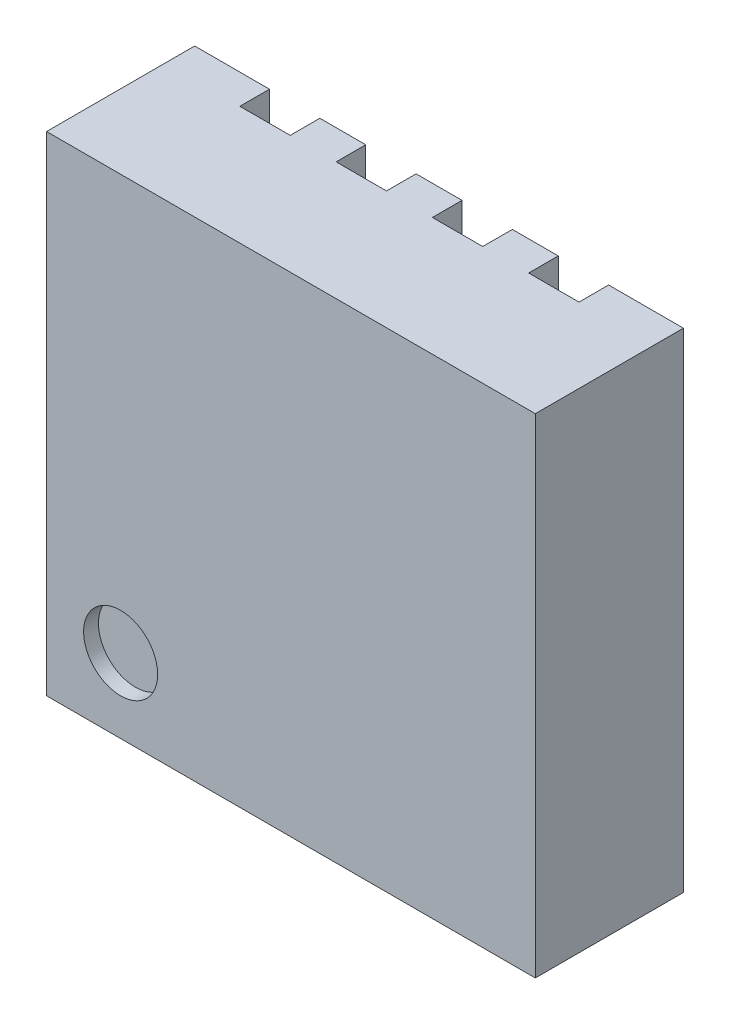
ISO-10303-21;
HEADER;
FILE_DESCRIPTION(('STEP AP214'),'2;1');
FILE_NAME('part.step','',(''),(''),'','','');
FILE_SCHEMA(('AUTOMOTIVE_DESIGN { 1 0 10303 214 1 1 1 1 }'));
ENDSEC;
DATA;
#1=APPLICATION_CONTEXT('core data for automotive mechanical design processes');
#2=APPLICATION_PROTOCOL_DEFINITION('international standard','automotive_design',2000,#1);
#3=PRODUCT_CONTEXT('',#1,'mechanical');
#4=PRODUCT('Part','Part','',(#3));
#5=PRODUCT_RELATED_PRODUCT_CATEGORY('part','',(#4));
#6=PRODUCT_DEFINITION_FORMATION('','',#4);
#7=PRODUCT_DEFINITION_CONTEXT('part definition',#1,'design');
#8=PRODUCT_DEFINITION('design','',#6,#7);
#9=PRODUCT_DEFINITION_SHAPE('','',#8);
#10=(LENGTH_UNIT() NAMED_UNIT(*) SI_UNIT(.MILLI.,.METRE.));
#11=(NAMED_UNIT(*) PLANE_ANGLE_UNIT() SI_UNIT($,.RADIAN.));
#12=(NAMED_UNIT(*) SI_UNIT($,.STERADIAN.) SOLID_ANGLE_UNIT());
#13=UNCERTAINTY_MEASURE_WITH_UNIT(LENGTH_MEASURE(1.E-05),#10,'distance_accuracy_value','');
#14=(GEOMETRIC_REPRESENTATION_CONTEXT(3) GLOBAL_UNCERTAINTY_ASSIGNED_CONTEXT((#13)) GLOBAL_UNIT_ASSIGNED_CONTEXT((#10,
#11,#12)) REPRESENTATION_CONTEXT('',''));
#15=CARTESIAN_POINT('',(0.,0.,0.));
#16=DIRECTION('',(0.,0.,1.));
#17=DIRECTION('',(1.,0.,0.));
#18=AXIS2_PLACEMENT_3D('',#15,#16,#17);
#19=CARTESIAN_POINT('',(0.,0.,0.));
#20=DIRECTION('',(0.,0.,1.));
#21=DIRECTION('',(1.,0.,0.));
#22=AXIS2_PLACEMENT_3D('',#19,#20,#21);
#23=PLANE('',#22);
#24=DIRECTION('',(-1.,0.,0.));
#25=VECTOR('',#24,1.);
#26=CARTESIAN_POINT('',(-1.65,1.65,0.));
#27=LINE('',#26,#25);
#28=CARTESIAN_POINT('',(0.805,1.65,0.));
#29=VERTEX_POINT('',#28);
#30=CARTESIAN_POINT('',(0.495,1.65,0.));
#31=VERTEX_POINT('',#30);
#32=EDGE_CURVE('E501',#29,#31,#27,.T.);
#33=ORIENTED_EDGE('',*,*,#32,.F.);
#34=DIRECTION('',(0.,1.,0.));
#35=VECTOR('',#34,1.);
#36=CARTESIAN_POINT('',(0.805,1.25,0.));
#37=LINE('',#36,#35);
#38=CARTESIAN_POINT('',(0.805,1.25,0.));
#39=VERTEX_POINT('',#38);
#40=EDGE_CURVE('E294',#39,#29,#37,.T.);
#41=ORIENTED_EDGE('',*,*,#40,.F.);
#42=DIRECTION('',(1.,0.,0.));
#43=VECTOR('',#42,1.);
#44=CARTESIAN_POINT('',(0.495,1.25,0.));
#45=LINE('',#44,#43);
#46=CARTESIAN_POINT('',(0.495,1.25,0.));
#47=VERTEX_POINT('',#46);
#48=EDGE_CURVE('E583',#47,#39,#45,.T.);
#49=ORIENTED_EDGE('',*,*,#48,.F.);
#50=DIRECTION('',(0.,-1.,0.));
#51=VECTOR('',#50,1.);
#52=CARTESIAN_POINT('',(0.495,1.65,0.));
#53=LINE('',#52,#51);
#54=EDGE_CURVE('E579',#31,#47,#53,.T.);
#55=ORIENTED_EDGE('',*,*,#54,.F.);
#56=EDGE_LOOP('',(#33,#41,#49,#55));
#57=FACE_BOUND('',#56,.T.);
#58=ADVANCED_FACE('F40',(#57),#23,.F.);
#59=CARTESIAN_POINT('',(0.155,1.65,0.));
#60=VERTEX_POINT('',#59);
#61=CARTESIAN_POINT('',(-0.155,1.65,0.));
#62=VERTEX_POINT('',#61);
#63=EDGE_CURVE('E694',#60,#62,#27,.T.);
#64=ORIENTED_EDGE('',*,*,#63,.F.);
#65=DIRECTION('',(0.,1.,0.));
#66=VECTOR('',#65,1.);
#67=CARTESIAN_POINT('',(0.155,1.65,0.));
#68=LINE('',#67,#66);
#69=CARTESIAN_POINT('',(0.155,1.25,0.));
#70=VERTEX_POINT('',#69);
#71=EDGE_CURVE('E576',#70,#60,#68,.T.);
#72=ORIENTED_EDGE('',*,*,#71,.F.);
#73=DIRECTION('',(1.,0.,0.));
#74=VECTOR('',#73,1.);
#75=CARTESIAN_POINT('',(0.155,1.25,0.));
#76=LINE('',#75,#74);
#77=CARTESIAN_POINT('',(-0.155,1.25,0.));
#78=VERTEX_POINT('',#77);
#79=EDGE_CURVE('E572',#78,#70,#76,.T.);
#80=ORIENTED_EDGE('',*,*,#79,.F.);
#81=DIRECTION('',(0.,-1.,0.));
#82=VECTOR('',#81,1.);
#83=CARTESIAN_POINT('',(-0.155,1.25,0.));
#84=LINE('',#83,#82);
#85=EDGE_CURVE('E568',#62,#78,#84,.T.);
#86=ORIENTED_EDGE('',*,*,#85,.F.);
#87=EDGE_LOOP('',(#64,#72,#80,#86));
#88=FACE_BOUND('',#87,.T.);
#89=ADVANCED_FACE('F723',(#88),#23,.F.);
#90=CARTESIAN_POINT('',(-0.495,1.65,0.));
#91=VERTEX_POINT('',#90);
#92=CARTESIAN_POINT('',(-0.805,1.65,0.));
#93=VERTEX_POINT('',#92);
#94=EDGE_CURVE('E697',#91,#93,#27,.T.);
#95=ORIENTED_EDGE('',*,*,#94,.F.);
#96=DIRECTION('',(0.,1.,0.));
#97=VECTOR('',#96,1.);
#98=CARTESIAN_POINT('',(-0.495,1.25,0.));
#99=LINE('',#98,#97);
#100=CARTESIAN_POINT('',(-0.495,1.25,0.));
#101=VERTEX_POINT('',#100);
#102=EDGE_CURVE('E565',#101,#91,#99,.T.);
#103=ORIENTED_EDGE('',*,*,#102,.F.);
#104=DIRECTION('',(1.,0.,0.));
#105=VECTOR('',#104,1.);
#106=CARTESIAN_POINT('',(-0.805,1.25,0.));
#107=LINE('',#106,#105);
#108=CARTESIAN_POINT('',(-0.805,1.25,0.));
#109=VERTEX_POINT('',#108);
#110=EDGE_CURVE('E561',#109,#101,#107,.T.);
#111=ORIENTED_EDGE('',*,*,#110,.F.);
#112=DIRECTION('',(0.,-1.,0.));
#113=VECTOR('',#112,1.);
#114=CARTESIAN_POINT('',(-0.805,1.65,0.));
#115=LINE('',#114,#113);
#116=EDGE_CURVE('E557',#93,#109,#115,.T.);
#117=ORIENTED_EDGE('',*,*,#116,.F.);
#118=EDGE_LOOP('',(#95,#103,#111,#117));
#119=FACE_BOUND('',#118,.T.);
#120=ADVANCED_FACE('F710',(#119),#23,.F.);
#121=DIRECTION('',(1.,0.,0.));
#122=VECTOR('',#121,1.);
#123=CARTESIAN_POINT('',(-1.65,-1.65,0.));
#124=LINE('',#123,#122);
#125=CARTESIAN_POINT('',(-0.805,-1.65,0.));
#126=VERTEX_POINT('',#125);
#127=CARTESIAN_POINT('',(-0.495,-1.65,0.));
#128=VERTEX_POINT('',#127);
#129=EDGE_CURVE('E508',#126,#128,#124,.T.);
#130=ORIENTED_EDGE('',*,*,#129,.F.);
#131=DIRECTION('',(0.,-1.,0.));
#132=VECTOR('',#131,1.);
#133=CARTESIAN_POINT('',(-0.805,-1.45,0.));
#134=LINE('',#133,#132);
#135=CARTESIAN_POINT('',(-0.805,-1.45,0.));
#136=VERTEX_POINT('',#135);
#137=EDGE_CURVE('E315',#136,#126,#134,.T.);
#138=ORIENTED_EDGE('',*,*,#137,.F.);
#139=DIRECTION('',(-1.,0.,0.));
#140=VECTOR('',#139,1.);
#141=CARTESIAN_POINT('',(-0.495,-1.45,0.));
#142=LINE('',#141,#140);
#143=CARTESIAN_POINT('',(-0.495,-1.45,0.));
#144=VERTEX_POINT('',#143);
#145=EDGE_CURVE('E387',#144,#136,#142,.T.);
#146=ORIENTED_EDGE('',*,*,#145,.F.);
#147=DIRECTION('',(0.,1.,0.));
#148=VECTOR('',#147,1.);
#149=CARTESIAN_POINT('',(-0.495,-1.65,0.));
#150=LINE('',#149,#148);
#151=EDGE_CURVE('E383',#128,#144,#150,.T.);
#152=ORIENTED_EDGE('',*,*,#151,.F.);
#153=EDGE_LOOP('',(#130,#138,#146,#152));
#154=FACE_BOUND('',#153,.T.);
#155=ADVANCED_FACE('F766',(#154),#23,.F.);
#156=CARTESIAN_POINT('',(-0.155,-1.65,0.));
#157=VERTEX_POINT('',#156);
#158=CARTESIAN_POINT('',(0.155,-1.65,0.));
#159=VERTEX_POINT('',#158);
#160=EDGE_CURVE('E777',#157,#159,#124,.T.);
#161=ORIENTED_EDGE('',*,*,#160,.F.);
#162=DIRECTION('',(0.,-1.,0.));
#163=VECTOR('',#162,1.);
#164=CARTESIAN_POINT('',(-0.155,-1.45,0.));
#165=LINE('',#164,#163);
#166=CARTESIAN_POINT('',(-0.155,-1.45,0.));
#167=VERTEX_POINT('',#166);
#168=EDGE_CURVE('E380',#167,#157,#165,.T.);
#169=ORIENTED_EDGE('',*,*,#168,.F.);
#170=DIRECTION('',(-1.,0.,0.));
#171=VECTOR('',#170,1.);
#172=CARTESIAN_POINT('',(0.155,-1.45,0.));
#173=LINE('',#172,#171);
#174=CARTESIAN_POINT('',(0.155,-1.45,0.));
#175=VERTEX_POINT('',#174);
#176=EDGE_CURVE('E376',#175,#167,#173,.T.);
#177=ORIENTED_EDGE('',*,*,#176,.F.);
#178=DIRECTION('',(0.,1.,0.));
#179=VECTOR('',#178,1.);
#180=CARTESIAN_POINT('',(0.155,-1.65,0.));
#181=LINE('',#180,#179);
#182=EDGE_CURVE('E372',#159,#175,#181,.T.);
#183=ORIENTED_EDGE('',*,*,#182,.F.);
#184=EDGE_LOOP('',(#161,#169,#177,#183));
#185=FACE_BOUND('',#184,.T.);
#186=ADVANCED_FACE('F754',(#185),#23,.F.);
#187=CARTESIAN_POINT('',(1.65,1.65,1.));
#188=DIRECTION('',(-1.,0.,0.));
#189=DIRECTION('',(0.,-1.,0.));
#190=AXIS2_PLACEMENT_3D('',#187,#188,#189);
#191=PLANE('',#190);
#192=DIRECTION('',(0.,1.,0.));
#193=VECTOR('',#192,1.);
#194=CARTESIAN_POINT('',(1.65,1.65,0.));
#195=LINE('',#194,#193);
#196=CARTESIAN_POINT('',(1.65,-1.65,0.));
#197=VERTEX_POINT('',#196);
#198=CARTESIAN_POINT('',(1.65,1.65,0.));
#199=VERTEX_POINT('',#198);
#200=EDGE_CURVE('E473',#197,#199,#195,.T.);
#201=ORIENTED_EDGE('',*,*,#200,.T.);
#202=DIRECTION('',(0.,0.,-1.));
#203=VECTOR('',#202,1.);
#204=CARTESIAN_POINT('',(1.65,1.65,1.));
#205=LINE('',#204,#203);
#206=CARTESIAN_POINT('',(1.65,1.65,1.));
#207=VERTEX_POINT('',#206);
#208=EDGE_CURVE('E11',#207,#199,#205,.T.);
#209=ORIENTED_EDGE('',*,*,#208,.F.);
#210=DIRECTION('',(0.,1.,0.));
#211=VECTOR('',#210,1.);
#212=CARTESIAN_POINT('',(1.65,1.65,1.));
#213=LINE('',#212,#211);
#214=CARTESIAN_POINT('',(1.65,-1.65,1.));
#215=VERTEX_POINT('',#214);
#216=EDGE_CURVE('E479',#215,#207,#213,.T.);
#217=ORIENTED_EDGE('',*,*,#216,.F.);
#218=DIRECTION('',(0.,0.,-1.));
#219=VECTOR('',#218,1.);
#220=CARTESIAN_POINT('',(1.65,-1.65,1.));
#221=LINE('',#220,#219);
#222=EDGE_CURVE('E493',#215,#197,#221,.T.);
#223=ORIENTED_EDGE('',*,*,#222,.T.);
#224=EDGE_LOOP('',(#201,#209,#217,#223));
#225=FACE_BOUND('',#224,.T.);
#226=ADVANCED_FACE('F42',(#225),#191,.F.);
#227=CARTESIAN_POINT('',(-1.65,1.65,1.));
#228=DIRECTION('',(0.,-1.,0.));
#229=DIRECTION('',(0.,0.,-1.));
#230=AXIS2_PLACEMENT_3D('',#227,#228,#229);
#231=PLANE('',#230);
#232=ORIENTED_EDGE('',*,*,#94,.T.);
#233=DIRECTION('',(0.,0.,-1.));
#234=VECTOR('',#233,1.);
#235=CARTESIAN_POINT('',(-0.805,1.65,0.2));
#236=LINE('',#235,#234);
#237=CARTESIAN_POINT('',(-0.805,1.65,0.2));
#238=VERTEX_POINT('',#237);
#239=EDGE_CURVE('E623',#238,#93,#236,.T.);
#240=ORIENTED_EDGE('',*,*,#239,.F.);
#241=DIRECTION('',(1.,0.,0.));
#242=VECTOR('',#241,1.);
#243=CARTESIAN_POINT('',(-1.145,1.65,0.2));
#244=LINE('',#243,#242);
#245=CARTESIAN_POINT('',(-1.145,1.65,0.2));
#246=VERTEX_POINT('',#245);
#247=EDGE_CURVE('E640',#246,#238,#244,.T.);
#248=ORIENTED_EDGE('',*,*,#247,.F.);
#249=DIRECTION('',(0.,0.,-1.));
#250=VECTOR('',#249,1.);
#251=CARTESIAN_POINT('',(-1.145,1.65,0.2));
#252=LINE('',#251,#250);
#253=CARTESIAN_POINT('',(-1.145,1.65,0.));
#254=VERTEX_POINT('',#253);
#255=EDGE_CURVE('E626',#246,#254,#252,.T.);
#256=ORIENTED_EDGE('',*,*,#255,.T.);
#257=CARTESIAN_POINT('',(-1.65,1.65,0.));
#258=VERTEX_POINT('',#257);
#259=EDGE_CURVE('E497',#254,#258,#27,.T.);
#260=ORIENTED_EDGE('',*,*,#259,.T.);
#261=DIRECTION('',(0.,0.,-1.));
#262=VECTOR('',#261,1.);
#263=CARTESIAN_POINT('',(-1.65,1.65,1.));
#264=LINE('',#263,#262);
#265=CARTESIAN_POINT('',(-1.65,1.65,1.));
#266=VERTEX_POINT('',#265);
#267=EDGE_CURVE('E49',#266,#258,#264,.T.);
#268=ORIENTED_EDGE('',*,*,#267,.F.);
#269=DIRECTION('',(-1.,0.,0.));
#270=VECTOR('',#269,1.);
#271=CARTESIAN_POINT('',(-1.65,1.65,1.));
#272=LINE('',#271,#270);
#273=EDGE_CURVE('E483',#207,#266,#272,.T.);
#274=ORIENTED_EDGE('',*,*,#273,.F.);
#275=ORIENTED_EDGE('',*,*,#208,.T.);
#276=CARTESIAN_POINT('',(1.145,1.65,0.));
#277=VERTEX_POINT('',#276);
#278=EDGE_CURVE('E299',#199,#277,#27,.T.);
#279=ORIENTED_EDGE('',*,*,#278,.T.);
#280=DIRECTION('',(0.,0.,-1.));
#281=VECTOR('',#280,1.);
#282=CARTESIAN_POINT('',(1.145,1.65,0.2));
#283=LINE('',#282,#281);
#284=CARTESIAN_POINT('',(1.145,1.65,0.2));
#285=VERTEX_POINT('',#284);
#286=EDGE_CURVE('E56',#285,#277,#283,.T.);
#287=ORIENTED_EDGE('',*,*,#286,.F.);
#288=DIRECTION('',(1.,0.,0.));
#289=VECTOR('',#288,1.);
#290=CARTESIAN_POINT('',(0.805,1.65,0.2));
#291=LINE('',#290,#289);
#292=CARTESIAN_POINT('',(0.805,1.65,0.2));
#293=VERTEX_POINT('',#292);
#294=EDGE_CURVE('E283',#293,#285,#291,.T.);
#295=ORIENTED_EDGE('',*,*,#294,.F.);
#296=DIRECTION('',(0.,0.,-1.));
#297=VECTOR('',#296,1.);
#298=CARTESIAN_POINT('',(0.805,1.65,0.2));
#299=LINE('',#298,#297);
#300=EDGE_CURVE('E478',#293,#29,#299,.T.);
#301=ORIENTED_EDGE('',*,*,#300,.T.);
#302=ORIENTED_EDGE('',*,*,#32,.T.);
#303=DIRECTION('',(0.,0.,-1.));
#304=VECTOR('',#303,1.);
#305=CARTESIAN_POINT('',(0.495,1.65,0.2));
#306=LINE('',#305,#304);
#307=CARTESIAN_POINT('',(0.495,1.65,0.2));
#308=VERTEX_POINT('',#307);
#309=EDGE_CURVE('E597',#308,#31,#306,.T.);
#310=ORIENTED_EDGE('',*,*,#309,.F.);
#311=DIRECTION('',(1.,0.,0.));
#312=VECTOR('',#311,1.);
#313=CARTESIAN_POINT('',(0.495,1.65,0.2));
#314=LINE('',#313,#312);
#315=CARTESIAN_POINT('',(0.155,1.65,0.2));
#316=VERTEX_POINT('',#315);
#317=EDGE_CURVE('E674',#316,#308,#314,.T.);
#318=ORIENTED_EDGE('',*,*,#317,.F.);
#319=DIRECTION('',(0.,0.,-1.));
#320=VECTOR('',#319,1.);
#321=CARTESIAN_POINT('',(0.155,1.65,0.2));
#322=LINE('',#321,#320);
#323=EDGE_CURVE('E600',#316,#60,#322,.T.);
#324=ORIENTED_EDGE('',*,*,#323,.T.);
#325=ORIENTED_EDGE('',*,*,#63,.T.);
#326=DIRECTION('',(0.,0.,-1.));
#327=VECTOR('',#326,1.);
#328=CARTESIAN_POINT('',(-0.155,1.65,0.2));
#329=LINE('',#328,#327);
#330=CARTESIAN_POINT('',(-0.155,1.65,0.2));
#331=VERTEX_POINT('',#330);
#332=EDGE_CURVE('E610',#331,#62,#329,.T.);
#333=ORIENTED_EDGE('',*,*,#332,.F.);
#334=DIRECTION('',(1.,0.,0.));
#335=VECTOR('',#334,1.);
#336=CARTESIAN_POINT('',(-0.155,1.65,0.2));
#337=LINE('',#336,#335);
#338=CARTESIAN_POINT('',(-0.495,1.65,0.2));
#339=VERTEX_POINT('',#338);
#340=EDGE_CURVE('E658',#339,#331,#337,.T.);
#341=ORIENTED_EDGE('',*,*,#340,.F.);
#342=DIRECTION('',(0.,0.,-1.));
#343=VECTOR('',#342,1.);
#344=CARTESIAN_POINT('',(-0.495,1.65,0.2));
#345=LINE('',#344,#343);
#346=EDGE_CURVE('E613',#339,#91,#345,.T.);
#347=ORIENTED_EDGE('',*,*,#346,.T.);
#348=EDGE_LOOP('',(#232,#240,#248,#256,#260,#268,#274,#275,#279,#287,#295,#301,#302,#310,#318,
#324,#325,#333,#341,#347));
#349=FACE_BOUND('',#348,.T.);
#350=ADVANCED_FACE('F298',(#349),#231,.F.);
#351=CARTESIAN_POINT('',(-1.65,1.65,1.));
#352=DIRECTION('',(1.,0.,0.));
#353=DIRECTION('',(0.,1.,0.));
#354=AXIS2_PLACEMENT_3D('',#351,#352,#353);
#355=PLANE('',#354);
#356=DIRECTION('',(0.,-1.,0.));
#357=VECTOR('',#356,1.);
#358=CARTESIAN_POINT('',(-1.65,1.65,0.));
#359=LINE('',#358,#357);
#360=CARTESIAN_POINT('',(-1.65,-1.65,0.));
#361=VERTEX_POINT('',#360);
#362=EDGE_CURVE('E500',#258,#361,#359,.T.);
#363=ORIENTED_EDGE('',*,*,#362,.T.);
#364=DIRECTION('',(0.,0.,-1.));
#365=VECTOR('',#364,1.);
#366=CARTESIAN_POINT('',(-1.65,-1.65,1.));
#367=LINE('',#366,#365);
#368=CARTESIAN_POINT('',(-1.65,-1.65,1.));
#369=VERTEX_POINT('',#368);
#370=EDGE_CURVE('E512',#369,#361,#367,.T.);
#371=ORIENTED_EDGE('',*,*,#370,.F.);
#372=DIRECTION('',(0.,-1.,0.));
#373=VECTOR('',#372,1.);
#374=CARTESIAN_POINT('',(-1.65,1.65,1.));
#375=LINE('',#374,#373);
#376=EDGE_CURVE('E487',#266,#369,#375,.T.);
#377=ORIENTED_EDGE('',*,*,#376,.F.);
#378=ORIENTED_EDGE('',*,*,#267,.T.);
#379=EDGE_LOOP('',(#363,#371,#377,#378));
#380=FACE_BOUND('',#379,.T.);
#381=ADVANCED_FACE('F521',(#380),#355,.F.);
#382=CARTESIAN_POINT('',(-1.65,-1.65,1.));
#383=DIRECTION('',(0.,1.,0.));
#384=DIRECTION('',(0.,0.,1.));
#385=AXIS2_PLACEMENT_3D('',#382,#383,#384);
#386=PLANE('',#385);
#387=ORIENTED_EDGE('',*,*,#160,.T.);
#388=DIRECTION('',(0.,0.,-1.));
#389=VECTOR('',#388,1.);
#390=CARTESIAN_POINT('',(0.155,-1.65,0.2));
#391=LINE('',#390,#389);
#392=CARTESIAN_POINT('',(0.155,-1.65,0.2));
#393=VERTEX_POINT('',#392);
#394=EDGE_CURVE('E417',#393,#159,#391,.T.);
#395=ORIENTED_EDGE('',*,*,#394,.F.);
#396=DIRECTION('',(-1.,0.,0.));
#397=VECTOR('',#396,1.);
#398=CARTESIAN_POINT('',(0.495,-1.65,0.2));
#399=LINE('',#398,#397);
#400=CARTESIAN_POINT('',(0.495,-1.65,0.2));
#401=VERTEX_POINT('',#400);
#402=EDGE_CURVE('E327',#401,#393,#399,.T.);
#403=ORIENTED_EDGE('',*,*,#402,.F.);
#404=DIRECTION('',(0.,0.,-1.));
#405=VECTOR('',#404,1.);
#406=CARTESIAN_POINT('',(0.495,-1.65,0.2));
#407=LINE('',#406,#405);
#408=CARTESIAN_POINT('',(0.495,-1.65,0.));
#409=VERTEX_POINT('',#408);
#410=EDGE_CURVE('E420',#401,#409,#407,.T.);
#411=ORIENTED_EDGE('',*,*,#410,.T.);
#412=CARTESIAN_POINT('',(0.805,-1.65,0.));
#413=VERTEX_POINT('',#412);
#414=EDGE_CURVE('E781',#409,#413,#124,.T.);
#415=ORIENTED_EDGE('',*,*,#414,.T.);
#416=DIRECTION('',(0.,0.,-1.));
#417=VECTOR('',#416,1.);
#418=CARTESIAN_POINT('',(0.805,-1.65,0.2));
#419=LINE('',#418,#417);
#420=CARTESIAN_POINT('',(0.805,-1.65,0.2));
#421=VERTEX_POINT('',#420);
#422=EDGE_CURVE('E64',#421,#413,#419,.T.);
#423=ORIENTED_EDGE('',*,*,#422,.F.);
#424=DIRECTION('',(-1.,0.,0.));
#425=VECTOR('',#424,1.);
#426=CARTESIAN_POINT('',(1.145,-1.65,0.2));
#427=LINE('',#426,#425);
#428=CARTESIAN_POINT('',(1.145,-1.65,0.2));
#429=VERTEX_POINT('',#428);
#430=EDGE_CURVE('E432',#429,#421,#427,.T.);
#431=ORIENTED_EDGE('',*,*,#430,.F.);
#432=DIRECTION('',(0.,0.,-1.));
#433=VECTOR('',#432,1.);
#434=CARTESIAN_POINT('',(1.145,-1.65,0.2));
#435=LINE('',#434,#433);
#436=CARTESIAN_POINT('',(1.145,-1.65,0.));
#437=VERTEX_POINT('',#436);
#438=EDGE_CURVE('E365',#429,#437,#435,.T.);
#439=ORIENTED_EDGE('',*,*,#438,.T.);
#440=EDGE_CURVE('E504',#437,#197,#124,.T.);
#441=ORIENTED_EDGE('',*,*,#440,.T.);
#442=ORIENTED_EDGE('',*,*,#222,.F.);
#443=DIRECTION('',(1.,0.,0.));
#444=VECTOR('',#443,1.);
#445=CARTESIAN_POINT('',(-1.65,-1.65,1.));
#446=LINE('',#445,#444);
#447=EDGE_CURVE('E490',#369,#215,#446,.T.);
#448=ORIENTED_EDGE('',*,*,#447,.F.);
#449=ORIENTED_EDGE('',*,*,#370,.T.);
#450=CARTESIAN_POINT('',(-1.145,-1.65,0.));
#451=VERTEX_POINT('',#450);
#452=EDGE_CURVE('E484',#361,#451,#124,.T.);
#453=ORIENTED_EDGE('',*,*,#452,.T.);
#454=DIRECTION('',(0.,0.,-1.));
#455=VECTOR('',#454,1.);
#456=CARTESIAN_POINT('',(-1.145,-1.65,0.2));
#457=LINE('',#456,#455);
#458=CARTESIAN_POINT('',(-1.145,-1.65,0.2));
#459=VERTEX_POINT('',#458);
#460=EDGE_CURVE('E359',#459,#451,#457,.T.);
#461=ORIENTED_EDGE('',*,*,#460,.F.);
#462=DIRECTION('',(-1.,0.,0.));
#463=VECTOR('',#462,1.);
#464=CARTESIAN_POINT('',(-0.805,-1.65,0.2));
#465=LINE('',#464,#463);
#466=CARTESIAN_POINT('',(-0.805,-1.65,0.2));
#467=VERTEX_POINT('',#466);
#468=EDGE_CURVE('E310',#467,#459,#465,.T.);
#469=ORIENTED_EDGE('',*,*,#468,.F.);
#470=DIRECTION('',(0.,0.,-1.));
#471=VECTOR('',#470,1.);
#472=CARTESIAN_POINT('',(-0.805,-1.65,0.2));
#473=LINE('',#472,#471);
#474=EDGE_CURVE('E393',#467,#126,#473,.T.);
#475=ORIENTED_EDGE('',*,*,#474,.T.);
#476=ORIENTED_EDGE('',*,*,#129,.T.);
#477=DIRECTION('',(0.,0.,-1.));
#478=VECTOR('',#477,1.);
#479=CARTESIAN_POINT('',(-0.495,-1.65,0.2));
#480=LINE('',#479,#478);
#481=CARTESIAN_POINT('',(-0.495,-1.65,0.2));
#482=VERTEX_POINT('',#481);
#483=EDGE_CURVE('E404',#482,#128,#480,.T.);
#484=ORIENTED_EDGE('',*,*,#483,.F.);
#485=DIRECTION('',(-1.,0.,0.));
#486=VECTOR('',#485,1.);
#487=CARTESIAN_POINT('',(-0.155,-1.65,0.2));
#488=LINE('',#487,#486);
#489=CARTESIAN_POINT('',(-0.155,-1.65,0.2));
#490=VERTEX_POINT('',#489);
#491=EDGE_CURVE('E343',#490,#482,#488,.T.);
#492=ORIENTED_EDGE('',*,*,#491,.F.);
#493=DIRECTION('',(0.,0.,-1.));
#494=VECTOR('',#493,1.);
#495=CARTESIAN_POINT('',(-0.155,-1.65,0.2));
#496=LINE('',#495,#494);
#497=EDGE_CURVE('E407',#490,#157,#496,.T.);
#498=ORIENTED_EDGE('',*,*,#497,.T.);
#499=EDGE_LOOP('',(#387,#395,#403,#411,#415,#423,#431,#439,#441,#442,#448,#449,#453,#461,#469,
#475,#476,#484,#492,#498));
#500=FACE_BOUND('',#499,.T.);
#501=ADVANCED_FACE('F533',(#500),#386,.F.);
#502=CARTESIAN_POINT('',(0.,0.,1.));
#503=DIRECTION('',(0.,0.,1.));
#504=DIRECTION('',(1.,0.,0.));
#505=AXIS2_PLACEMENT_3D('',#502,#503,#504);
#506=PLANE('',#505);
#507=CARTESIAN_POINT('',(-1.15,-1.15,1.));
#508=DIRECTION('',(0.,0.,1.));
#509=DIRECTION('',(1.,0.,0.));
#510=AXIS2_PLACEMENT_3D('',#507,#508,#509);
#511=CIRCLE('',#510,0.25);
#512=CARTESIAN_POINT('',(-0.9,-1.15,1.));
#513=VERTEX_POINT('',#512);
#514=EDGE_CURVE('E474',#513,#513,#511,.T.);
#515=ORIENTED_EDGE('',*,*,#514,.F.);
#516=EDGE_LOOP('',(#515));
#517=FACE_BOUND('',#516,.T.);
#518=ORIENTED_EDGE('',*,*,#216,.T.);
#519=ORIENTED_EDGE('',*,*,#273,.T.);
#520=ORIENTED_EDGE('',*,*,#376,.T.);
#521=ORIENTED_EDGE('',*,*,#447,.T.);
#522=EDGE_LOOP('',(#518,#519,#520,#521));
#523=FACE_BOUND('',#522,.T.);
#524=ADVANCED_FACE('F539',(#517,#523),#506,.T.);
#525=ORIENTED_EDGE('',*,*,#259,.F.);
#526=DIRECTION('',(0.,1.,0.));
#527=VECTOR('',#526,1.);
#528=CARTESIAN_POINT('',(-1.145,-0.46,0.));
#529=LINE('',#528,#527);
#530=CARTESIAN_POINT('',(-1.145,-0.46,0.));
#531=VERTEX_POINT('',#530);
#532=EDGE_CURVE('E551',#531,#254,#529,.T.);
#533=ORIENTED_EDGE('',*,*,#532,.F.);
#534=DIRECTION('',(-1.,0.,0.));
#535=VECTOR('',#534,1.);
#536=CARTESIAN_POINT('',(1.145,-0.46,0.));
#537=LINE('',#536,#535);
#538=CARTESIAN_POINT('',(1.145,-0.46,0.));
#539=VERTEX_POINT('',#538);
#540=EDGE_CURVE('E547',#539,#531,#537,.T.);
#541=ORIENTED_EDGE('',*,*,#540,.F.);
#542=DIRECTION('',(0.,-1.,0.));
#543=VECTOR('',#542,1.);
#544=CARTESIAN_POINT('',(1.145,1.65,0.));
#545=LINE('',#544,#543);
#546=EDGE_CURVE('E397',#277,#539,#545,.T.);
#547=ORIENTED_EDGE('',*,*,#546,.F.);
#548=ORIENTED_EDGE('',*,*,#278,.F.);
#549=ORIENTED_EDGE('',*,*,#200,.F.);
#550=ORIENTED_EDGE('',*,*,#440,.F.);
#551=DIRECTION('',(0.,-1.,0.));
#552=VECTOR('',#551,1.);
#553=CARTESIAN_POINT('',(1.145,-1.15,0.));
#554=LINE('',#553,#552);
#555=CARTESIAN_POINT('',(1.145,-1.15,0.));
#556=VERTEX_POINT('',#555);
#557=EDGE_CURVE('E437',#556,#437,#554,.T.);
#558=ORIENTED_EDGE('',*,*,#557,.F.);
#559=DIRECTION('',(1.,0.,0.));
#560=VECTOR('',#559,1.);
#561=CARTESIAN_POINT('',(0.805,-1.15,0.));
#562=LINE('',#561,#560);
#563=CARTESIAN_POINT('',(0.805,-1.15,0.));
#564=VERTEX_POINT('',#563);
#565=EDGE_CURVE('E452',#564,#556,#562,.T.);
#566=ORIENTED_EDGE('',*,*,#565,.F.);
#567=DIRECTION('',(0.,1.,0.));
#568=VECTOR('',#567,1.);
#569=CARTESIAN_POINT('',(0.805,-1.65,0.));
#570=LINE('',#569,#568);
#571=EDGE_CURVE('E449',#413,#564,#570,.T.);
#572=ORIENTED_EDGE('',*,*,#571,.F.);
#573=ORIENTED_EDGE('',*,*,#414,.F.);
#574=DIRECTION('',(0.,-1.,0.));
#575=VECTOR('',#574,1.);
#576=CARTESIAN_POINT('',(0.495,-1.05,0.));
#577=LINE('',#576,#575);
#578=CARTESIAN_POINT('',(0.495,-1.05,0.));
#579=VERTEX_POINT('',#578);
#580=EDGE_CURVE('E369',#579,#409,#577,.T.);
#581=ORIENTED_EDGE('',*,*,#580,.F.);
#582=DIRECTION('',(1.,0.,0.));
#583=VECTOR('',#582,1.);
#584=CARTESIAN_POINT('',(-1.145,-1.05,0.));
#585=LINE('',#584,#583);
#586=CARTESIAN_POINT('',(-1.145,-1.05,0.));
#587=VERTEX_POINT('',#586);
#588=EDGE_CURVE('E364',#587,#579,#585,.T.);
#589=ORIENTED_EDGE('',*,*,#588,.F.);
#590=DIRECTION('',(0.,1.,0.));
#591=VECTOR('',#590,1.);
#592=CARTESIAN_POINT('',(-1.145,-1.65,0.));
#593=LINE('',#592,#591);
#594=EDGE_CURVE('E360',#451,#587,#593,.T.);
#595=ORIENTED_EDGE('',*,*,#594,.F.);
#596=ORIENTED_EDGE('',*,*,#452,.F.);
#597=ORIENTED_EDGE('',*,*,#362,.F.);
#598=EDGE_LOOP('',(#525,#533,#541,#547,#548,#549,#550,#558,#566,#572,#573,#581,#589,#595,#596,#597));
#599=FACE_BOUND('',#598,.T.);
#600=ADVANCED_FACE('F526',(#599),#23,.F.);
#601=CARTESIAN_POINT('',(-1.15,-1.15,0.9));
#602=DIRECTION('',(0.,0.,1.));
#603=DIRECTION('',(1.,0.,0.));
#604=AXIS2_PLACEMENT_3D('',#601,#602,#603);
#605=CYLINDRICAL_SURFACE('',#604,0.25);
#606=CARTESIAN_POINT('',(-1.15,-1.15,0.9));
#607=DIRECTION('',(0.,0.,1.));
#608=DIRECTION('',(1.,0.,0.));
#609=AXIS2_PLACEMENT_3D('',#606,#607,#608);
#610=CIRCLE('',#609,0.25);
#611=CARTESIAN_POINT('',(-0.9,-1.15,0.9));
#612=VERTEX_POINT('',#611);
#613=EDGE_CURVE('E469',#612,#612,#610,.T.);
#614=ORIENTED_EDGE('',*,*,#613,.F.);
#615=EDGE_LOOP('',(#614));
#616=FACE_BOUND('',#615,.T.);
#617=ORIENTED_EDGE('',*,*,#514,.T.);
#618=EDGE_LOOP('',(#617));
#619=FACE_BOUND('',#618,.T.);
#620=ADVANCED_FACE('F753',(#616,#619),#605,.F.);
#621=CARTESIAN_POINT('',(-1.15,-1.15,0.9));
#622=DIRECTION('',(0.,0.,1.));
#623=DIRECTION('',(1.,0.,0.));
#624=AXIS2_PLACEMENT_3D('',#621,#622,#623);
#625=PLANE('',#624);
#626=ORIENTED_EDGE('',*,*,#613,.T.);
#627=EDGE_LOOP('',(#626));
#628=FACE_BOUND('',#627,.T.);
#629=ADVANCED_FACE('F760',(#628),#625,.T.);
#630=CARTESIAN_POINT('',(1.145,-1.15,0.2));
#631=DIRECTION('',(1.,0.,0.));
#632=DIRECTION('',(0.,0.,-1.));
#633=AXIS2_PLACEMENT_3D('',#630,#631,#632);
#634=PLANE('',#633);
#635=ORIENTED_EDGE('',*,*,#557,.T.);
#636=ORIENTED_EDGE('',*,*,#438,.F.);
#637=DIRECTION('',(0.,-1.,0.));
#638=VECTOR('',#637,1.);
#639=CARTESIAN_POINT('',(1.145,-1.15,0.2));
#640=LINE('',#639,#638);
#641=CARTESIAN_POINT('',(1.145,-1.15,0.2));
#642=VERTEX_POINT('',#641);
#643=EDGE_CURVE('E445',#642,#429,#640,.T.);
#644=ORIENTED_EDGE('',*,*,#643,.F.);
#645=DIRECTION('',(0.,0.,-1.));
#646=VECTOR('',#645,1.);
#647=CARTESIAN_POINT('',(1.145,-1.15,0.2));
#648=LINE('',#647,#646);
#649=EDGE_CURVE('E461',#642,#556,#648,.T.);
#650=ORIENTED_EDGE('',*,*,#649,.T.);
#651=EDGE_LOOP('',(#635,#636,#644,#650));
#652=FACE_BOUND('',#651,.T.);
#653=ADVANCED_FACE('F791',(#652),#634,.F.);
#654=CARTESIAN_POINT('',(0.805,-1.15,0.2));
#655=DIRECTION('',(0.,1.,0.));
#656=DIRECTION('',(0.,0.,1.));
#657=AXIS2_PLACEMENT_3D('',#654,#655,#656);
#658=PLANE('',#657);
#659=ORIENTED_EDGE('',*,*,#565,.T.);
#660=ORIENTED_EDGE('',*,*,#649,.F.);
#661=DIRECTION('',(1.,0.,0.));
#662=VECTOR('',#661,1.);
#663=CARTESIAN_POINT('',(0.805,-1.15,0.2));
#664=LINE('',#663,#662);
#665=CARTESIAN_POINT('',(0.805,-1.15,0.2));
#666=VERTEX_POINT('',#665);
#667=EDGE_CURVE('E441',#666,#642,#664,.T.);
#668=ORIENTED_EDGE('',*,*,#667,.F.);
#669=DIRECTION('',(0.,0.,-1.));
#670=VECTOR('',#669,1.);
#671=CARTESIAN_POINT('',(0.805,-1.15,0.2));
#672=LINE('',#671,#670);
#673=EDGE_CURVE('E464',#666,#564,#672,.T.);
#674=ORIENTED_EDGE('',*,*,#673,.T.);
#675=EDGE_LOOP('',(#659,#660,#668,#674));
#676=FACE_BOUND('',#675,.T.);
#677=ADVANCED_FACE('F796',(#676),#658,.F.);
#678=CARTESIAN_POINT('',(0.805,-1.65,0.2));
#679=DIRECTION('',(-1.,0.,0.));
#680=DIRECTION('',(0.,0.,1.));
#681=AXIS2_PLACEMENT_3D('',#678,#679,#680);
#682=PLANE('',#681);
#683=ORIENTED_EDGE('',*,*,#571,.T.);
#684=ORIENTED_EDGE('',*,*,#673,.F.);
#685=DIRECTION('',(0.,1.,0.));
#686=VECTOR('',#685,1.);
#687=CARTESIAN_POINT('',(0.805,-1.65,0.2));
#688=LINE('',#687,#686);
#689=EDGE_CURVE('E436',#421,#666,#688,.T.);
#690=ORIENTED_EDGE('',*,*,#689,.F.);
#691=ORIENTED_EDGE('',*,*,#422,.T.);
#692=EDGE_LOOP('',(#683,#684,#690,#691));
#693=FACE_BOUND('',#692,.T.);
#694=ADVANCED_FACE('F799',(#693),#682,.F.);
#695=CARTESIAN_POINT('',(0.,0.,0.2));
#696=DIRECTION('',(0.,0.,-1.));
#697=DIRECTION('',(-1.,0.,0.));
#698=AXIS2_PLACEMENT_3D('',#695,#696,#697);
#699=PLANE('',#698);
#700=ORIENTED_EDGE('',*,*,#430,.T.);
#701=ORIENTED_EDGE('',*,*,#689,.T.);
#702=ORIENTED_EDGE('',*,*,#667,.T.);
#703=ORIENTED_EDGE('',*,*,#643,.T.);
#704=EDGE_LOOP('',(#700,#701,#702,#703));
#705=FACE_BOUND('',#704,.T.);
#706=ADVANCED_FACE('F793',(#705),#699,.T.);
#707=CARTESIAN_POINT('',(-0.805,-1.45,0.2));
#708=DIRECTION('',(1.,0.,0.));
#709=DIRECTION('',(0.,0.,-1.));
#710=AXIS2_PLACEMENT_3D('',#707,#708,#709);
#711=PLANE('',#710);
#712=ORIENTED_EDGE('',*,*,#137,.T.);
#713=ORIENTED_EDGE('',*,*,#474,.F.);
#714=DIRECTION('',(0.,-1.,0.));
#715=VECTOR('',#714,1.);
#716=CARTESIAN_POINT('',(-0.805,-1.45,0.2));
#717=LINE('',#716,#715);
#718=CARTESIAN_POINT('',(-0.805,-1.45,0.2));
#719=VERTEX_POINT('',#718);
#720=EDGE_CURVE('E355',#719,#467,#717,.T.);
#721=ORIENTED_EDGE('',*,*,#720,.F.);
#722=DIRECTION('',(0.,0.,-1.));
#723=VECTOR('',#722,1.);
#724=CARTESIAN_POINT('',(-0.805,-1.45,0.2));
#725=LINE('',#724,#723);
#726=EDGE_CURVE('E398',#719,#136,#725,.T.);
#727=ORIENTED_EDGE('',*,*,#726,.T.);
#728=EDGE_LOOP('',(#712,#713,#721,#727));
#729=FACE_BOUND('',#728,.T.);
#730=ADVANCED_FACE('F806',(#729),#711,.F.);
#731=CARTESIAN_POINT('',(-0.495,-1.45,0.2));
#732=DIRECTION('',(0.,-1.,0.));
#733=DIRECTION('',(0.,0.,-1.));
#734=AXIS2_PLACEMENT_3D('',#731,#732,#733);
#735=PLANE('',#734);
#736=ORIENTED_EDGE('',*,*,#145,.T.);
#737=ORIENTED_EDGE('',*,*,#726,.F.);
#738=DIRECTION('',(-1.,0.,0.));
#739=VECTOR('',#738,1.);
#740=CARTESIAN_POINT('',(-0.495,-1.45,0.2));
#741=LINE('',#740,#739);
#742=CARTESIAN_POINT('',(-0.495,-1.45,0.2));
#743=VERTEX_POINT('',#742);
#744=EDGE_CURVE('E351',#743,#719,#741,.T.);
#745=ORIENTED_EDGE('',*,*,#744,.F.);
#746=DIRECTION('',(0.,0.,-1.));
#747=VECTOR('',#746,1.);
#748=CARTESIAN_POINT('',(-0.495,-1.45,0.2));
#749=LINE('',#748,#747);
#750=EDGE_CURVE('E401',#743,#144,#749,.T.);
#751=ORIENTED_EDGE('',*,*,#750,.T.);
#752=EDGE_LOOP('',(#736,#737,#745,#751));
#753=FACE_BOUND('',#752,.T.);
#754=ADVANCED_FACE('F849',(#753),#735,.F.);
#755=CARTESIAN_POINT('',(-0.495,-1.65,0.2));
#756=DIRECTION('',(-1.,0.,0.));
#757=DIRECTION('',(0.,0.,1.));
#758=AXIS2_PLACEMENT_3D('',#755,#756,#757);
#759=PLANE('',#758);
#760=ORIENTED_EDGE('',*,*,#151,.T.);
#761=ORIENTED_EDGE('',*,*,#750,.F.);
#762=DIRECTION('',(0.,1.,0.));
#763=VECTOR('',#762,1.);
#764=CARTESIAN_POINT('',(-0.495,-1.65,0.2));
#765=LINE('',#764,#763);
#766=EDGE_CURVE('E347',#482,#743,#765,.T.);
#767=ORIENTED_EDGE('',*,*,#766,.F.);
#768=ORIENTED_EDGE('',*,*,#483,.T.);
#769=EDGE_LOOP('',(#760,#761,#767,#768));
#770=FACE_BOUND('',#769,.T.);
#771=ADVANCED_FACE('F845',(#770),#759,.F.);
#772=CARTESIAN_POINT('',(-0.155,-1.45,0.2));
#773=DIRECTION('',(1.,0.,0.));
#774=DIRECTION('',(0.,1.,0.));
#775=AXIS2_PLACEMENT_3D('',#772,#773,#774);
#776=PLANE('',#775);
#777=ORIENTED_EDGE('',*,*,#168,.T.);
#778=ORIENTED_EDGE('',*,*,#497,.F.);
#779=DIRECTION('',(0.,-1.,0.));
#780=VECTOR('',#779,1.);
#781=CARTESIAN_POINT('',(-0.155,-1.45,0.2));
#782=LINE('',#781,#780);
#783=CARTESIAN_POINT('',(-0.155,-1.45,0.2));
#784=VERTEX_POINT('',#783);
#785=EDGE_CURVE('E339',#784,#490,#782,.T.);
#786=ORIENTED_EDGE('',*,*,#785,.F.);
#787=DIRECTION('',(0.,0.,-1.));
#788=VECTOR('',#787,1.);
#789=CARTESIAN_POINT('',(-0.155,-1.45,0.2));
#790=LINE('',#789,#788);
#791=EDGE_CURVE('E411',#784,#167,#790,.T.);
#792=ORIENTED_EDGE('',*,*,#791,.T.);
#793=EDGE_LOOP('',(#777,#778,#786,#792));
#794=FACE_BOUND('',#793,.T.);
#795=ADVANCED_FACE('F841',(#794),#776,.F.);
#796=CARTESIAN_POINT('',(0.155,-1.45,0.2));
#797=DIRECTION('',(0.,-1.,0.));
#798=DIRECTION('',(0.,0.,-1.));
#799=AXIS2_PLACEMENT_3D('',#796,#797,#798);
#800=PLANE('',#799);
#801=ORIENTED_EDGE('',*,*,#176,.T.);
#802=ORIENTED_EDGE('',*,*,#791,.F.);
#803=DIRECTION('',(-1.,0.,0.));
#804=VECTOR('',#803,1.);
#805=CARTESIAN_POINT('',(0.155,-1.45,0.2));
#806=LINE('',#805,#804);
#807=CARTESIAN_POINT('',(0.155,-1.45,0.2));
#808=VERTEX_POINT('',#807);
#809=EDGE_CURVE('E335',#808,#784,#806,.T.);
#810=ORIENTED_EDGE('',*,*,#809,.F.);
#811=DIRECTION('',(0.,0.,-1.));
#812=VECTOR('',#811,1.);
#813=CARTESIAN_POINT('',(0.155,-1.45,0.2));
#814=LINE('',#813,#812);
#815=EDGE_CURVE('E414',#808,#175,#814,.T.);
#816=ORIENTED_EDGE('',*,*,#815,.T.);
#817=EDGE_LOOP('',(#801,#802,#810,#816));
#818=FACE_BOUND('',#817,.T.);
#819=ADVANCED_FACE('F837',(#818),#800,.F.);
#820=CARTESIAN_POINT('',(0.155,-1.65,0.2));
#821=DIRECTION('',(-1.,0.,0.));
#822=DIRECTION('',(0.,0.,1.));
#823=AXIS2_PLACEMENT_3D('',#820,#821,#822);
#824=PLANE('',#823);
#825=ORIENTED_EDGE('',*,*,#182,.T.);
#826=ORIENTED_EDGE('',*,*,#815,.F.);
#827=DIRECTION('',(0.,1.,0.));
#828=VECTOR('',#827,1.);
#829=CARTESIAN_POINT('',(0.155,-1.65,0.2));
#830=LINE('',#829,#828);
#831=EDGE_CURVE('E331',#393,#808,#830,.T.);
#832=ORIENTED_EDGE('',*,*,#831,.F.);
#833=ORIENTED_EDGE('',*,*,#394,.T.);
#834=EDGE_LOOP('',(#825,#826,#832,#833));
#835=FACE_BOUND('',#834,.T.);
#836=ADVANCED_FACE('F833',(#835),#824,.F.);
#837=CARTESIAN_POINT('',(0.495,-1.05,0.2));
#838=DIRECTION('',(1.,0.,0.));
#839=DIRECTION('',(0.,0.,-1.));
#840=AXIS2_PLACEMENT_3D('',#837,#838,#839);
#841=PLANE('',#840);
#842=ORIENTED_EDGE('',*,*,#580,.T.);
#843=ORIENTED_EDGE('',*,*,#410,.F.);
#844=DIRECTION('',(0.,-1.,0.));
#845=VECTOR('',#844,1.);
#846=CARTESIAN_POINT('',(0.495,-1.05,0.2));
#847=LINE('',#846,#845);
#848=CARTESIAN_POINT('',(0.495,-1.05,0.2));
#849=VERTEX_POINT('',#848);
#850=EDGE_CURVE('E323',#849,#401,#847,.T.);
#851=ORIENTED_EDGE('',*,*,#850,.F.);
#852=DIRECTION('',(0.,0.,-1.));
#853=VECTOR('',#852,1.);
#854=CARTESIAN_POINT('',(0.495,-1.05,0.2));
#855=LINE('',#854,#853);
#856=EDGE_CURVE('E424',#849,#579,#855,.T.);
#857=ORIENTED_EDGE('',*,*,#856,.T.);
#858=EDGE_LOOP('',(#842,#843,#851,#857));
#859=FACE_BOUND('',#858,.T.);
#860=ADVANCED_FACE('F829',(#859),#841,.F.);
#861=CARTESIAN_POINT('',(-1.145,-1.05,0.2));
#862=DIRECTION('',(0.,1.,0.));
#863=DIRECTION('',(-1.,0.,0.));
#864=AXIS2_PLACEMENT_3D('',#861,#862,#863);
#865=PLANE('',#864);
#866=ORIENTED_EDGE('',*,*,#588,.T.);
#867=ORIENTED_EDGE('',*,*,#856,.F.);
#868=DIRECTION('',(1.,0.,0.));
#869=VECTOR('',#868,1.);
#870=CARTESIAN_POINT('',(-1.145,-1.05,0.2));
#871=LINE('',#870,#869);
#872=CARTESIAN_POINT('',(-1.145,-1.05,0.2));
#873=VERTEX_POINT('',#872);
#874=EDGE_CURVE('E319',#873,#849,#871,.T.);
#875=ORIENTED_EDGE('',*,*,#874,.F.);
#876=DIRECTION('',(0.,0.,-1.));
#877=VECTOR('',#876,1.);
#878=CARTESIAN_POINT('',(-1.145,-1.05,0.2));
#879=LINE('',#878,#877);
#880=EDGE_CURVE('E427',#873,#587,#879,.T.);
#881=ORIENTED_EDGE('',*,*,#880,.T.);
#882=EDGE_LOOP('',(#866,#867,#875,#881));
#883=FACE_BOUND('',#882,.T.);
#884=ADVANCED_FACE('F825',(#883),#865,.F.);
#885=CARTESIAN_POINT('',(-1.145,-1.65,0.2));
#886=DIRECTION('',(-1.,0.,0.));
#887=DIRECTION('',(0.,-1.,0.));
#888=AXIS2_PLACEMENT_3D('',#885,#886,#887);
#889=PLANE('',#888);
#890=ORIENTED_EDGE('',*,*,#594,.T.);
#891=ORIENTED_EDGE('',*,*,#880,.F.);
#892=DIRECTION('',(0.,1.,0.));
#893=VECTOR('',#892,1.);
#894=CARTESIAN_POINT('',(-1.145,-1.65,0.2));
#895=LINE('',#894,#893);
#896=EDGE_CURVE('E314',#459,#873,#895,.T.);
#897=ORIENTED_EDGE('',*,*,#896,.F.);
#898=ORIENTED_EDGE('',*,*,#460,.T.);
#899=EDGE_LOOP('',(#890,#891,#897,#898));
#900=FACE_BOUND('',#899,.T.);
#901=ADVANCED_FACE('F822',(#900),#889,.F.);
#902=CARTESIAN_POINT('',(0.,0.,0.2));
#903=DIRECTION('',(0.,0.,-1.));
#904=DIRECTION('',(-1.,0.,0.));
#905=AXIS2_PLACEMENT_3D('',#902,#903,#904);
#906=PLANE('',#905);
#907=ORIENTED_EDGE('',*,*,#468,.T.);
#908=ORIENTED_EDGE('',*,*,#896,.T.);
#909=ORIENTED_EDGE('',*,*,#874,.T.);
#910=ORIENTED_EDGE('',*,*,#850,.T.);
#911=ORIENTED_EDGE('',*,*,#402,.T.);
#912=ORIENTED_EDGE('',*,*,#831,.T.);
#913=ORIENTED_EDGE('',*,*,#809,.T.);
#914=ORIENTED_EDGE('',*,*,#785,.T.);
#915=ORIENTED_EDGE('',*,*,#491,.T.);
#916=ORIENTED_EDGE('',*,*,#766,.T.);
#917=ORIENTED_EDGE('',*,*,#744,.T.);
#918=ORIENTED_EDGE('',*,*,#720,.T.);
#919=EDGE_LOOP('',(#907,#908,#909,#910,#911,#912,#913,#914,#915,#916,#917,#918));
#920=FACE_BOUND('',#919,.T.);
#921=ADVANCED_FACE('F742',(#920),#906,.T.);
#922=CARTESIAN_POINT('',(0.805,1.25,0.2));
#923=DIRECTION('',(-1.,0.,0.));
#924=DIRECTION('',(0.,0.,1.));
#925=AXIS2_PLACEMENT_3D('',#922,#923,#924);
#926=PLANE('',#925);
#927=ORIENTED_EDGE('',*,*,#40,.T.);
#928=ORIENTED_EDGE('',*,*,#300,.F.);
#929=DIRECTION('',(0.,1.,0.));
#930=VECTOR('',#929,1.);
#931=CARTESIAN_POINT('',(0.805,1.25,0.2));
#932=LINE('',#931,#930);
#933=CARTESIAN_POINT('',(0.805,1.25,0.2));
#934=VERTEX_POINT('',#933);
#935=EDGE_CURVE('E290',#934,#293,#932,.T.);
#936=ORIENTED_EDGE('',*,*,#935,.F.);
#937=DIRECTION('',(0.,0.,-1.));
#938=VECTOR('',#937,1.);
#939=CARTESIAN_POINT('',(0.805,1.25,0.2));
#940=LINE('',#939,#938);
#941=EDGE_CURVE('E591',#934,#39,#940,.T.);
#942=ORIENTED_EDGE('',*,*,#941,.T.);
#943=EDGE_LOOP('',(#927,#928,#936,#942));
#944=FACE_BOUND('',#943,.T.);
#945=ADVANCED_FACE('F685',(#944),#926,.F.);
#946=CARTESIAN_POINT('',(0.495,1.25,0.2));
#947=DIRECTION('',(0.,1.,0.));
#948=DIRECTION('',(0.,0.,1.));
#949=AXIS2_PLACEMENT_3D('',#946,#947,#948);
#950=PLANE('',#949);
#951=ORIENTED_EDGE('',*,*,#48,.T.);
#952=ORIENTED_EDGE('',*,*,#941,.F.);
#953=DIRECTION('',(1.,0.,0.));
#954=VECTOR('',#953,1.);
#955=CARTESIAN_POINT('',(0.495,1.25,0.2));
#956=LINE('',#955,#954);
#957=CARTESIAN_POINT('',(0.495,1.25,0.2));
#958=VERTEX_POINT('',#957);
#959=EDGE_CURVE('E306',#958,#934,#956,.T.);
#960=ORIENTED_EDGE('',*,*,#959,.F.);
#961=DIRECTION('',(0.,0.,-1.));
#962=VECTOR('',#961,1.);
#963=CARTESIAN_POINT('',(0.495,1.25,0.2));
#964=LINE('',#963,#962);
#965=EDGE_CURVE('E594',#958,#47,#964,.T.);
#966=ORIENTED_EDGE('',*,*,#965,.T.);
#967=EDGE_LOOP('',(#951,#952,#960,#966));
#968=FACE_BOUND('',#967,.T.);
#969=ADVANCED_FACE('F733',(#968),#950,.F.);
#970=CARTESIAN_POINT('',(0.495,1.65,0.2));
#971=DIRECTION('',(1.,0.,0.));
#972=DIRECTION('',(0.,0.,-1.));
#973=AXIS2_PLACEMENT_3D('',#970,#971,#972);
#974=PLANE('',#973);
#975=ORIENTED_EDGE('',*,*,#54,.T.);
#976=ORIENTED_EDGE('',*,*,#965,.F.);
#977=DIRECTION('',(0.,-1.,0.));
#978=VECTOR('',#977,1.);
#979=CARTESIAN_POINT('',(0.495,1.65,0.2));
#980=LINE('',#979,#978);
#981=EDGE_CURVE('E678',#308,#958,#980,.T.);
#982=ORIENTED_EDGE('',*,*,#981,.F.);
#983=ORIENTED_EDGE('',*,*,#309,.T.);
#984=EDGE_LOOP('',(#975,#976,#982,#983));
#985=FACE_BOUND('',#984,.T.);
#986=ADVANCED_FACE('F732',(#985),#974,.F.);
#987=CARTESIAN_POINT('',(0.155,1.65,0.2));
#988=DIRECTION('',(-1.,0.,0.));
#989=DIRECTION('',(0.,-1.,0.));
#990=AXIS2_PLACEMENT_3D('',#987,#988,#989);
#991=PLANE('',#990);
#992=ORIENTED_EDGE('',*,*,#71,.T.);
#993=ORIENTED_EDGE('',*,*,#323,.F.);
#994=DIRECTION('',(0.,1.,0.));
#995=VECTOR('',#994,1.);
#996=CARTESIAN_POINT('',(0.155,1.65,0.2));
#997=LINE('',#996,#995);
#998=CARTESIAN_POINT('',(0.155,1.25,0.2));
#999=VERTEX_POINT('',#998);
#1000=EDGE_CURVE('E670',#999,#316,#997,.T.);
#1001=ORIENTED_EDGE('',*,*,#1000,.F.);
#1002=DIRECTION('',(0.,0.,-1.));
#1003=VECTOR('',#1002,1.);
#1004=CARTESIAN_POINT('',(0.155,1.25,0.2));
#1005=LINE('',#1004,#1003);
#1006=EDGE_CURVE('E604',#999,#70,#1005,.T.);
#1007=ORIENTED_EDGE('',*,*,#1006,.T.);
#1008=EDGE_LOOP('',(#992,#993,#1001,#1007));
#1009=FACE_BOUND('',#1008,.T.);
#1010=ADVANCED_FACE('F740',(#1009),#991,.F.);
#1011=CARTESIAN_POINT('',(0.155,1.25,0.2));
#1012=DIRECTION('',(0.,1.,0.));
#1013=DIRECTION('',(0.,0.,1.));
#1014=AXIS2_PLACEMENT_3D('',#1011,#1012,#1013);
#1015=PLANE('',#1014);
#1016=ORIENTED_EDGE('',*,*,#79,.T.);
#1017=ORIENTED_EDGE('',*,*,#1006,.F.);
#1018=DIRECTION('',(1.,0.,0.));
#1019=VECTOR('',#1018,1.);
#1020=CARTESIAN_POINT('',(0.155,1.25,0.2));
#1021=LINE('',#1020,#1019);
#1022=CARTESIAN_POINT('',(-0.155,1.25,0.2));
#1023=VERTEX_POINT('',#1022);
#1024=EDGE_CURVE('E666',#1023,#999,#1021,.T.);
#1025=ORIENTED_EDGE('',*,*,#1024,.F.);
#1026=DIRECTION('',(0.,0.,-1.));
#1027=VECTOR('',#1026,1.);
#1028=CARTESIAN_POINT('',(-0.155,1.25,0.2));
#1029=LINE('',#1028,#1027);
#1030=EDGE_CURVE('E607',#1023,#78,#1029,.T.);
#1031=ORIENTED_EDGE('',*,*,#1030,.T.);
#1032=EDGE_LOOP('',(#1016,#1017,#1025,#1031));
#1033=FACE_BOUND('',#1032,.T.);
#1034=ADVANCED_FACE('F726',(#1033),#1015,.F.);
#1035=CARTESIAN_POINT('',(-0.155,1.25,0.2));
#1036=DIRECTION('',(1.,0.,0.));
#1037=DIRECTION('',(0.,0.,-1.));
#1038=AXIS2_PLACEMENT_3D('',#1035,#1036,#1037);
#1039=PLANE('',#1038);
#1040=ORIENTED_EDGE('',*,*,#85,.T.);
#1041=ORIENTED_EDGE('',*,*,#1030,.F.);
#1042=DIRECTION('',(0.,-1.,0.));
#1043=VECTOR('',#1042,1.);
#1044=CARTESIAN_POINT('',(-0.155,1.25,0.2));
#1045=LINE('',#1044,#1043);
#1046=EDGE_CURVE('E662',#331,#1023,#1045,.T.);
#1047=ORIENTED_EDGE('',*,*,#1046,.F.);
#1048=ORIENTED_EDGE('',*,*,#332,.T.);
#1049=EDGE_LOOP('',(#1040,#1041,#1047,#1048));
#1050=FACE_BOUND('',#1049,.T.);
#1051=ADVANCED_FACE('F720',(#1050),#1039,.F.);
#1052=CARTESIAN_POINT('',(-0.495,1.25,0.2));
#1053=DIRECTION('',(-1.,0.,0.));
#1054=DIRECTION('',(0.,0.,1.));
#1055=AXIS2_PLACEMENT_3D('',#1052,#1053,#1054);
#1056=PLANE('',#1055);
#1057=ORIENTED_EDGE('',*,*,#102,.T.);
#1058=ORIENTED_EDGE('',*,*,#346,.F.);
#1059=DIRECTION('',(0.,1.,0.));
#1060=VECTOR('',#1059,1.);
#1061=CARTESIAN_POINT('',(-0.495,1.25,0.2));
#1062=LINE('',#1061,#1060);
#1063=CARTESIAN_POINT('',(-0.495,1.25,0.2));
#1064=VERTEX_POINT('',#1063);
#1065=EDGE_CURVE('E654',#1064,#339,#1062,.T.);
#1066=ORIENTED_EDGE('',*,*,#1065,.F.);
#1067=DIRECTION('',(0.,0.,-1.));
#1068=VECTOR('',#1067,1.);
#1069=CARTESIAN_POINT('',(-0.495,1.25,0.2));
#1070=LINE('',#1069,#1068);
#1071=EDGE_CURVE('E617',#1064,#101,#1070,.T.);
#1072=ORIENTED_EDGE('',*,*,#1071,.T.);
#1073=EDGE_LOOP('',(#1057,#1058,#1066,#1072));
#1074=FACE_BOUND('',#1073,.T.);
#1075=ADVANCED_FACE('F870',(#1074),#1056,.F.);
#1076=CARTESIAN_POINT('',(-0.805,1.25,0.2));
#1077=DIRECTION('',(0.,1.,0.));
#1078=DIRECTION('',(0.,0.,1.));
#1079=AXIS2_PLACEMENT_3D('',#1076,#1077,#1078);
#1080=PLANE('',#1079);
#1081=ORIENTED_EDGE('',*,*,#110,.T.);
#1082=ORIENTED_EDGE('',*,*,#1071,.F.);
#1083=DIRECTION('',(1.,0.,0.));
#1084=VECTOR('',#1083,1.);
#1085=CARTESIAN_POINT('',(-0.805,1.25,0.2));
#1086=LINE('',#1085,#1084);
#1087=CARTESIAN_POINT('',(-0.805,1.25,0.2));
#1088=VERTEX_POINT('',#1087);
#1089=EDGE_CURVE('E650',#1088,#1064,#1086,.T.);
#1090=ORIENTED_EDGE('',*,*,#1089,.F.);
#1091=DIRECTION('',(0.,0.,-1.));
#1092=VECTOR('',#1091,1.);
#1093=CARTESIAN_POINT('',(-0.805,1.25,0.2));
#1094=LINE('',#1093,#1092);
#1095=EDGE_CURVE('E620',#1088,#109,#1094,.T.);
#1096=ORIENTED_EDGE('',*,*,#1095,.T.);
#1097=EDGE_LOOP('',(#1081,#1082,#1090,#1096));
#1098=FACE_BOUND('',#1097,.T.);
#1099=ADVANCED_FACE('F713',(#1098),#1080,.F.);
#1100=CARTESIAN_POINT('',(-0.805,1.65,0.2));
#1101=DIRECTION('',(1.,0.,0.));
#1102=DIRECTION('',(0.,0.,-1.));
#1103=AXIS2_PLACEMENT_3D('',#1100,#1101,#1102);
#1104=PLANE('',#1103);
#1105=ORIENTED_EDGE('',*,*,#116,.T.);
#1106=ORIENTED_EDGE('',*,*,#1095,.F.);
#1107=DIRECTION('',(0.,-1.,0.));
#1108=VECTOR('',#1107,1.);
#1109=CARTESIAN_POINT('',(-0.805,1.65,0.2));
#1110=LINE('',#1109,#1108);
#1111=EDGE_CURVE('E646',#238,#1088,#1110,.T.);
#1112=ORIENTED_EDGE('',*,*,#1111,.F.);
#1113=ORIENTED_EDGE('',*,*,#239,.T.);
#1114=EDGE_LOOP('',(#1105,#1106,#1112,#1113));
#1115=FACE_BOUND('',#1114,.T.);
#1116=ADVANCED_FACE('F707',(#1115),#1104,.F.);
#1117=CARTESIAN_POINT('',(-1.145,-0.46,0.2));
#1118=DIRECTION('',(-1.,0.,0.));
#1119=DIRECTION('',(0.,0.,1.));
#1120=AXIS2_PLACEMENT_3D('',#1117,#1118,#1119);
#1121=PLANE('',#1120);
#1122=ORIENTED_EDGE('',*,*,#532,.T.);
#1123=ORIENTED_EDGE('',*,*,#255,.F.);
#1124=DIRECTION('',(0.,1.,0.));
#1125=VECTOR('',#1124,1.);
#1126=CARTESIAN_POINT('',(-1.145,-0.46,0.2));
#1127=LINE('',#1126,#1125);
#1128=CARTESIAN_POINT('',(-1.145,-0.46,0.2));
#1129=VERTEX_POINT('',#1128);
#1130=EDGE_CURVE('E634',#1129,#246,#1127,.T.);
#1131=ORIENTED_EDGE('',*,*,#1130,.F.);
#1132=DIRECTION('',(0.,0.,-1.));
#1133=VECTOR('',#1132,1.);
#1134=CARTESIAN_POINT('',(-1.145,-0.46,0.2));
#1135=LINE('',#1134,#1133);
#1136=EDGE_CURVE('E304',#1129,#531,#1135,.T.);
#1137=ORIENTED_EDGE('',*,*,#1136,.T.);
#1138=EDGE_LOOP('',(#1122,#1123,#1131,#1137));
#1139=FACE_BOUND('',#1138,.T.);
#1140=ADVANCED_FACE('F632',(#1139),#1121,.F.);
#1141=CARTESIAN_POINT('',(1.145,-0.46,0.2));
#1142=DIRECTION('',(0.,-1.,0.));
#1143=DIRECTION('',(1.,0.,0.));
#1144=AXIS2_PLACEMENT_3D('',#1141,#1142,#1143);
#1145=PLANE('',#1144);
#1146=ORIENTED_EDGE('',*,*,#540,.T.);
#1147=ORIENTED_EDGE('',*,*,#1136,.F.);
#1148=DIRECTION('',(-1.,0.,0.));
#1149=VECTOR('',#1148,1.);
#1150=CARTESIAN_POINT('',(1.145,-0.46,0.2));
#1151=LINE('',#1150,#1149);
#1152=CARTESIAN_POINT('',(1.145,-0.46,0.2));
#1153=VERTEX_POINT('',#1152);
#1154=EDGE_CURVE('E282',#1153,#1129,#1151,.T.);
#1155=ORIENTED_EDGE('',*,*,#1154,.F.);
#1156=DIRECTION('',(0.,0.,-1.));
#1157=VECTOR('',#1156,1.);
#1158=CARTESIAN_POINT('',(1.145,-0.46,0.2));
#1159=LINE('',#1158,#1157);
#1160=EDGE_CURVE('E277',#1153,#539,#1159,.T.);
#1161=ORIENTED_EDGE('',*,*,#1160,.T.);
#1162=EDGE_LOOP('',(#1146,#1147,#1155,#1161));
#1163=FACE_BOUND('',#1162,.T.);
#1164=ADVANCED_FACE('F636',(#1163),#1145,.F.);
#1165=CARTESIAN_POINT('',(1.145,1.65,0.2));
#1166=DIRECTION('',(1.,0.,0.));
#1167=DIRECTION('',(0.,1.,0.));
#1168=AXIS2_PLACEMENT_3D('',#1165,#1166,#1167);
#1169=PLANE('',#1168);
#1170=ORIENTED_EDGE('',*,*,#546,.T.);
#1171=ORIENTED_EDGE('',*,*,#1160,.F.);
#1172=DIRECTION('',(0.,-1.,0.));
#1173=VECTOR('',#1172,1.);
#1174=CARTESIAN_POINT('',(1.145,1.65,0.2));
#1175=LINE('',#1174,#1173);
#1176=EDGE_CURVE('E274',#285,#1153,#1175,.T.);
#1177=ORIENTED_EDGE('',*,*,#1176,.F.);
#1178=ORIENTED_EDGE('',*,*,#286,.T.);
#1179=EDGE_LOOP('',(#1170,#1171,#1177,#1178));
#1180=FACE_BOUND('',#1179,.T.);
#1181=ADVANCED_FACE('F276',(#1180),#1169,.F.);
#1182=CARTESIAN_POINT('',(0.,0.,0.2));
#1183=DIRECTION('',(0.,0.,-1.));
#1184=DIRECTION('',(-1.,0.,0.));
#1185=AXIS2_PLACEMENT_3D('',#1182,#1183,#1184);
#1186=PLANE('',#1185);
#1187=ORIENTED_EDGE('',*,*,#294,.T.);
#1188=ORIENTED_EDGE('',*,*,#1176,.T.);
#1189=ORIENTED_EDGE('',*,*,#1154,.T.);
#1190=ORIENTED_EDGE('',*,*,#1130,.T.);
#1191=ORIENTED_EDGE('',*,*,#247,.T.);
#1192=ORIENTED_EDGE('',*,*,#1111,.T.);
#1193=ORIENTED_EDGE('',*,*,#1089,.T.);
#1194=ORIENTED_EDGE('',*,*,#1065,.T.);
#1195=ORIENTED_EDGE('',*,*,#340,.T.);
#1196=ORIENTED_EDGE('',*,*,#1046,.T.);
#1197=ORIENTED_EDGE('',*,*,#1024,.T.);
#1198=ORIENTED_EDGE('',*,*,#1000,.T.);
#1199=ORIENTED_EDGE('',*,*,#317,.T.);
#1200=ORIENTED_EDGE('',*,*,#981,.T.);
#1201=ORIENTED_EDGE('',*,*,#959,.T.);
#1202=ORIENTED_EDGE('',*,*,#935,.T.);
#1203=EDGE_LOOP('',(#1187,#1188,#1189,#1190,#1191,#1192,#1193,#1194,#1195,#1196,#1197,#1198,
#1199,#1200,#1201,#1202));
#1204=FACE_BOUND('',#1203,.T.);
#1205=ADVANCED_FACE('F287',(#1204),#1186,.T.);
#1206=CLOSED_SHELL('',(#58,#89,#120,#155,#186,#226,#350,#381,#501,#524,#600,#620,#629,#653,#677,
#694,#706,#730,#754,#771,#795,#819,#836,#860,#884,#901,#921,#945,#969,#986,#1010,#1034,#1051,
#1075,#1099,#1116,#1140,#1164,#1181,#1205));
#1207=MANIFOLD_SOLID_BREP('B2',#1206);
#1208=ADVANCED_BREP_SHAPE_REPRESENTATION('',(#18,#1207),#14);
#1209=SHAPE_DEFINITION_REPRESENTATION(#9,#1208);
ENDSEC;
END-ISO-10303-21;
